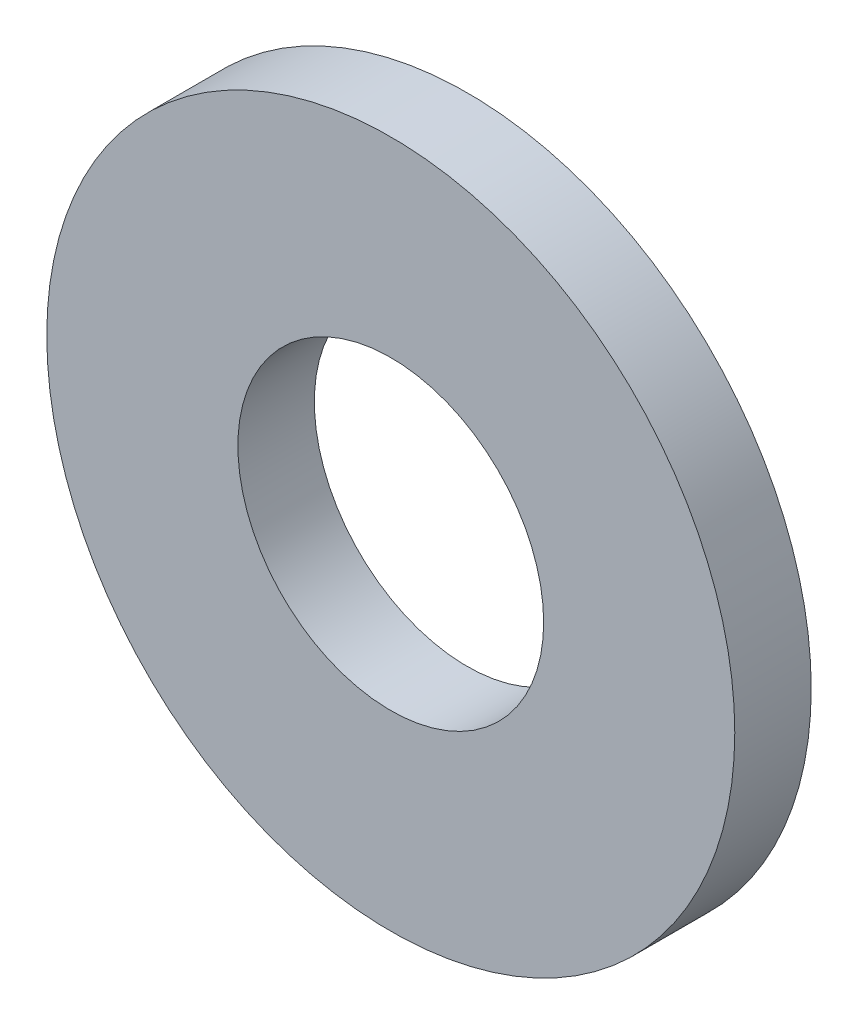
ISO-10303-21;
HEADER;
FILE_DESCRIPTION(('STEP AP214'),'2;1');
FILE_NAME('part.step','',(''),(''),'','','');
FILE_SCHEMA(('AUTOMOTIVE_DESIGN { 1 0 10303 214 1 1 1 1 }'));
ENDSEC;
DATA;
#1=APPLICATION_CONTEXT('core data for automotive mechanical design processes');
#2=APPLICATION_PROTOCOL_DEFINITION('international standard','automotive_design',2000,#1);
#3=PRODUCT_CONTEXT('',#1,'mechanical');
#4=PRODUCT('Part','Part','',(#3));
#5=PRODUCT_RELATED_PRODUCT_CATEGORY('part','',(#4));
#6=PRODUCT_DEFINITION_FORMATION('','',#4);
#7=PRODUCT_DEFINITION_CONTEXT('part definition',#1,'design');
#8=PRODUCT_DEFINITION('design','',#6,#7);
#9=PRODUCT_DEFINITION_SHAPE('','',#8);
#10=(LENGTH_UNIT() NAMED_UNIT(*) SI_UNIT(.MILLI.,.METRE.));
#11=(NAMED_UNIT(*) PLANE_ANGLE_UNIT() SI_UNIT($,.RADIAN.));
#12=(NAMED_UNIT(*) SI_UNIT($,.STERADIAN.) SOLID_ANGLE_UNIT());
#13=UNCERTAINTY_MEASURE_WITH_UNIT(LENGTH_MEASURE(1.E-05),#10,'distance_accuracy_value','');
#14=(GEOMETRIC_REPRESENTATION_CONTEXT(3) GLOBAL_UNCERTAINTY_ASSIGNED_CONTEXT((#13)) GLOBAL_UNIT_ASSIGNED_CONTEXT((#10,
#11,#12)) REPRESENTATION_CONTEXT('',''));
#15=CARTESIAN_POINT('',(0.,0.,0.));
#16=DIRECTION('',(0.,0.,1.));
#17=DIRECTION('',(1.,0.,0.));
#18=AXIS2_PLACEMENT_3D('',#15,#16,#17);
#19=CARTESIAN_POINT('',(0.,0.,1.5875));
#20=DIRECTION('',(0.,0.,1.));
#21=DIRECTION('',(1.,0.,0.));
#22=AXIS2_PLACEMENT_3D('',#19,#20,#21);
#23=PLANE('',#22);
#24=CARTESIAN_POINT('',(0.,0.,1.5875));
#25=DIRECTION('',(0.,0.,1.));
#26=DIRECTION('',(1.,0.,0.));
#27=AXIS2_PLACEMENT_3D('',#24,#25,#26);
#28=CIRCLE('',#27,7.14375);
#29=CARTESIAN_POINT('',(7.14375,0.,1.5875));
#30=VERTEX_POINT('',#29);
#31=EDGE_CURVE('E10',#30,#30,#28,.T.);
#32=ORIENTED_EDGE('',*,*,#31,.T.);
#33=EDGE_LOOP('',(#32));
#34=FACE_BOUND('',#33,.T.);
#35=CARTESIAN_POINT('',(0.,0.,1.5875));
#36=DIRECTION('',(0.,0.,1.));
#37=DIRECTION('',(1.,0.,0.));
#38=AXIS2_PLACEMENT_3D('',#35,#36,#37);
#39=CIRCLE('',#38,3.175);
#40=CARTESIAN_POINT('',(3.175,0.,1.5875));
#41=VERTEX_POINT('',#40);
#42=EDGE_CURVE('E48',#41,#41,#39,.T.);
#43=ORIENTED_EDGE('',*,*,#42,.F.);
#44=EDGE_LOOP('',(#43));
#45=FACE_BOUND('',#44,.T.);
#46=ADVANCED_FACE('F37',(#34,#45),#23,.T.);
#47=CARTESIAN_POINT('',(0.,0.,0.));
#48=DIRECTION('',(0.,0.,1.));
#49=DIRECTION('',(1.,0.,0.));
#50=AXIS2_PLACEMENT_3D('',#47,#48,#49);
#51=PLANE('',#50);
#52=CARTESIAN_POINT('',(0.,0.,0.));
#53=DIRECTION('',(0.,0.,1.));
#54=DIRECTION('',(1.,0.,0.));
#55=AXIS2_PLACEMENT_3D('',#52,#53,#54);
#56=CIRCLE('',#55,7.14375);
#57=CARTESIAN_POINT('',(7.14375,0.,0.));
#58=VERTEX_POINT('',#57);
#59=EDGE_CURVE('E41',#58,#58,#56,.T.);
#60=ORIENTED_EDGE('',*,*,#59,.F.);
#61=EDGE_LOOP('',(#60));
#62=FACE_BOUND('',#61,.T.);
#63=CARTESIAN_POINT('',(0.,0.,0.));
#64=DIRECTION('',(0.,0.,1.));
#65=DIRECTION('',(1.,0.,0.));
#66=AXIS2_PLACEMENT_3D('',#63,#64,#65);
#67=CIRCLE('',#66,3.175);
#68=CARTESIAN_POINT('',(3.175,0.,0.));
#69=VERTEX_POINT('',#68);
#70=EDGE_CURVE('E50',#69,#69,#67,.T.);
#71=ORIENTED_EDGE('',*,*,#70,.T.);
#72=EDGE_LOOP('',(#71));
#73=FACE_BOUND('',#72,.T.);
#74=ADVANCED_FACE('F60',(#62,#73),#51,.F.);
#75=CARTESIAN_POINT('',(0.,0.,1.5875));
#76=DIRECTION('',(0.,0.,-1.));
#77=DIRECTION('',(-1.,0.,0.));
#78=AXIS2_PLACEMENT_3D('',#75,#76,#77);
#79=CYLINDRICAL_SURFACE('',#78,7.14375);
#80=ORIENTED_EDGE('',*,*,#31,.F.);
#81=EDGE_LOOP('',(#80));
#82=FACE_BOUND('',#81,.T.);
#83=ORIENTED_EDGE('',*,*,#59,.T.);
#84=EDGE_LOOP('',(#83));
#85=FACE_BOUND('',#84,.T.);
#86=ADVANCED_FACE('F39',(#82,#85),#79,.T.);
#87=CARTESIAN_POINT('',(0.,0.,1.5875));
#88=DIRECTION('',(0.,0.,-1.));
#89=DIRECTION('',(-1.,0.,0.));
#90=AXIS2_PLACEMENT_3D('',#87,#88,#89);
#91=CYLINDRICAL_SURFACE('',#90,3.175);
#92=ORIENTED_EDGE('',*,*,#42,.T.);
#93=EDGE_LOOP('',(#92));
#94=FACE_BOUND('',#93,.T.);
#95=ORIENTED_EDGE('',*,*,#70,.F.);
#96=EDGE_LOOP('',(#95));
#97=FACE_BOUND('',#96,.T.);
#98=ADVANCED_FACE('F56',(#94,#97),#91,.F.);
#99=CLOSED_SHELL('',(#46,#74,#86,#98));
#100=MANIFOLD_SOLID_BREP('B2',#99);
#101=ADVANCED_BREP_SHAPE_REPRESENTATION('',(#18,#100),#14);
#102=SHAPE_DEFINITION_REPRESENTATION(#9,#101);
ENDSEC;
END-ISO-10303-21;
